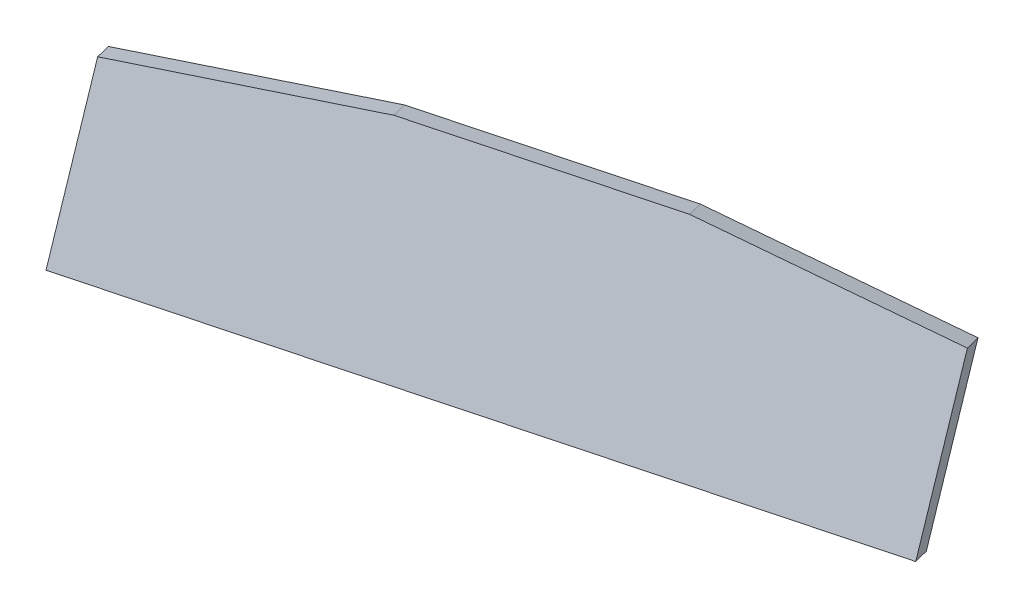
ISO-10303-21;
HEADER;
FILE_DESCRIPTION(('STEP AP214'),'2;1');
FILE_NAME('part.step','',(''),(''),'','','');
FILE_SCHEMA(('AUTOMOTIVE_DESIGN { 1 0 10303 214 1 1 1 1 }'));
ENDSEC;
DATA;
#1=APPLICATION_CONTEXT('core data for automotive mechanical design processes');
#2=APPLICATION_PROTOCOL_DEFINITION('international standard','automotive_design',2000,#1);
#3=PRODUCT_CONTEXT('',#1,'mechanical');
#4=PRODUCT('Part','Part','',(#3));
#5=PRODUCT_RELATED_PRODUCT_CATEGORY('part','',(#4));
#6=PRODUCT_DEFINITION_FORMATION('','',#4);
#7=PRODUCT_DEFINITION_CONTEXT('part definition',#1,'design');
#8=PRODUCT_DEFINITION('design','',#6,#7);
#9=PRODUCT_DEFINITION_SHAPE('','',#8);
#10=(LENGTH_UNIT() NAMED_UNIT(*) SI_UNIT(.MILLI.,.METRE.));
#11=(NAMED_UNIT(*) PLANE_ANGLE_UNIT() SI_UNIT($,.RADIAN.));
#12=(NAMED_UNIT(*) SI_UNIT($,.STERADIAN.) SOLID_ANGLE_UNIT());
#13=UNCERTAINTY_MEASURE_WITH_UNIT(LENGTH_MEASURE(1.E-05),#10,'distance_accuracy_value','');
#14=(GEOMETRIC_REPRESENTATION_CONTEXT(3) GLOBAL_UNCERTAINTY_ASSIGNED_CONTEXT((#13)) GLOBAL_UNIT_ASSIGNED_CONTEXT((#10,
#11,#12)) REPRESENTATION_CONTEXT('',''));
#15=CARTESIAN_POINT('',(0.,0.,0.));
#16=DIRECTION('',(0.,0.,1.));
#17=DIRECTION('',(1.,0.,0.));
#18=AXIS2_PLACEMENT_3D('',#15,#16,#17);
#19=CARTESIAN_POINT('',(124.,211.98475235449,-124.918123856454));
#20=DIRECTION('',(0.903470789906188,-0.132460029849933,-0.407670053202885));
#21=DIRECTION('',(-0.411294235020629,0.,-0.911502634246767));
#22=AXIS2_PLACEMENT_3D('',#19,#20,#21);
#23=PLANE('',#22);
#24=DIRECTION('',(0.,0.951056516295154,-0.309016994374947));
#25=VECTOR('',#24,1.);
#26=CARTESIAN_POINT('',(119.71350339104,133.108352770854,-108.789282126684));
#27=LINE('',#26,#25);
#28=CARTESIAN_POINT('',(119.71350339104,133.108352770854,-108.789282126684));
#29=VERTEX_POINT('',#28);
#30=CARTESIAN_POINT('',(119.71350339104,197.780195878924,-129.80243774418));
#31=VERTEX_POINT('',#30);
#32=EDGE_CURVE('E107',#29,#31,#27,.T.);
#33=ORIENTED_EDGE('',*,*,#32,.T.);
#34=DIRECTION('',(0.428649660896038,0.27918782800237,0.85925178202261));
#35=VECTOR('',#34,1.);
#36=CARTESIAN_POINT('',(1.29384842199959,120.651180555581,-367.181138443372));
#37=LINE('',#36,#35);
#38=CARTESIAN_POINT('',(124.,200.572074158948,-121.209919923954));
#39=VERTEX_POINT('',#38);
#40=EDGE_CURVE('E55',#31,#39,#37,.T.);
#41=ORIENTED_EDGE('',*,*,#40,.T.);
#42=DIRECTION('',(0.,-0.951056516295154,0.309016994374947));
#43=VECTOR('',#42,1.);
#44=CARTESIAN_POINT('',(124.,135.900231050877,-100.196764306458));
#45=LINE('',#44,#43);
#46=CARTESIAN_POINT('',(124.,135.900231050877,-100.196764306458));
#47=VERTEX_POINT('',#46);
#48=EDGE_CURVE('E104',#39,#47,#45,.T.);
#49=ORIENTED_EDGE('',*,*,#48,.T.);
#50=DIRECTION('',(-0.428649660896038,-0.279187828002372,-0.85925178202261));
#51=VECTOR('',#50,1.);
#52=CARTESIAN_POINT('',(124.,135.900231050877,-100.196764306458));
#53=LINE('',#52,#51);
#54=EDGE_CURVE('E123',#47,#29,#53,.T.);
#55=ORIENTED_EDGE('',*,*,#54,.T.);
#56=EDGE_LOOP('',(#33,#41,#49,#55));
#57=FACE_BOUND('',#56,.T.);
#58=ADVANCED_FACE('F40',(#57),#23,.T.);
#59=CARTESIAN_POINT('',(-122.856751695519,172.092494335495,11.1915685777226));
#60=DIRECTION('',(-0.428649660896038,-0.27918782800237,-0.85925178202261));
#61=DIRECTION('',(-0.894833483572199,0.,0.446400085884896));
#62=AXIS2_PLACEMENT_3D('',#59,#60,#61);
#63=PLANE('',#62);
#64=DIRECTION('',(-0.895368758447917,0.258354564960698,0.362722628408271));
#65=VECTOR('',#64,1.);
#66=CARTESIAN_POINT('',(31.622480966816,227.227185270193,-83.786884785186));
#67=LINE('',#66,#65);
#68=CARTESIAN_POINT('',(43.5910996983483,223.773695011134,-88.6354891213962));
#69=VERTEX_POINT('',#68);
#70=EDGE_CURVE('E91',#39,#69,#67,.T.);
#71=ORIENTED_EDGE('',*,*,#70,.T.);
#72=DIRECTION('',(0.903470789906188,-0.132460029849933,-0.407670053202885));
#73=VECTOR('',#72,1.);
#74=CARTESIAN_POINT('',(-122.85675169552,248.177015639107,-13.5297909722734));
#75=LINE('',#74,#73);
#76=CARTESIAN_POINT('',(-39.3046030893885,235.927233773394,-51.230742954366));
#77=VERTEX_POINT('',#76);
#78=EDGE_CURVE('E132',#77,#69,#75,.T.);
#79=ORIENTED_EDGE('',*,*,#78,.F.);
#80=DIRECTION('',(0.895368758447917,-0.00418977802359383,-0.445305773772976));
#81=VECTOR('',#80,1.);
#82=CARTESIAN_POINT('',(-27.3359843578547,235.871227959855,-57.1832569045715));
#83=LINE('',#82,#81);
#84=CARTESIAN_POINT('',(-119.71350339104,236.303498234497,-11.2399042868103));
#85=VERTEX_POINT('',#84);
#86=EDGE_CURVE('E154',#85,#77,#83,.T.);
#87=ORIENTED_EDGE('',*,*,#86,.F.);
#88=DIRECTION('',(0.,-0.951056516295154,0.309016994374947));
#89=VECTOR('',#88,1.);
#90=CARTESIAN_POINT('',(-119.713503391039,171.631655126426,9.7732513306865));
#91=LINE('',#90,#89);
#92=CARTESIAN_POINT('',(-119.713503391039,171.631655126426,9.7732513306865));
#93=VERTEX_POINT('',#92);
#94=EDGE_CURVE('E133',#85,#93,#91,.T.);
#95=ORIENTED_EDGE('',*,*,#94,.T.);
#96=DIRECTION('',(0.903470789906188,-0.132460029849933,-0.407670053202885));
#97=VECTOR('',#96,1.);
#98=CARTESIAN_POINT('',(-122.856751695519,172.092494335495,11.1915685777226));
#99=LINE('',#98,#97);
#100=EDGE_CURVE('E112',#93,#47,#99,.T.);
#101=ORIENTED_EDGE('',*,*,#100,.T.);
#102=ORIENTED_EDGE('',*,*,#48,.F.);
#103=EDGE_LOOP('',(#71,#79,#87,#95,#101,#102));
#104=FACE_BOUND('',#103,.T.);
#105=ADVANCED_FACE('F110',(#104),#63,.F.);
#106=CARTESIAN_POINT('',(-127.14324830448,245.385137359084,-22.1223087924998));
#107=DIRECTION('',(0.,-0.951056516295153,0.309016994374949));
#108=DIRECTION('',(0.,-0.309016994374949,-0.951056516295153));
#109=AXIS2_PLACEMENT_3D('',#106,#107,#108);
#110=PLANE('',#109);
#111=DIRECTION('',(0.428649660896038,0.27918782800237,0.85925178202261));
#112=VECTOR('',#111,1.);
#113=CARTESIAN_POINT('',(-79.1150518796523,143.852801407767,-334.606707640814));
#114=LINE('',#113,#112);
#115=CARTESIAN_POINT('',(39.3046030893879,220.98181673111,-97.2280069416227));
#116=VERTEX_POINT('',#115);
#117=EDGE_CURVE('E94',#116,#69,#114,.T.);
#118=ORIENTED_EDGE('',*,*,#117,.F.);
#119=DIRECTION('',(0.903470789906188,-0.132460029849933,-0.407670053202885));
#120=VECTOR('',#119,1.);
#121=CARTESIAN_POINT('',(-127.14324830448,245.385137359084,-22.1223087924998));
#122=LINE('',#121,#120);
#123=CARTESIAN_POINT('',(-43.5910996983481,233.13535549337,-59.8232607745925));
#124=VERTEX_POINT('',#123);
#125=EDGE_CURVE('E131',#124,#116,#122,.T.);
#126=ORIENTED_EDGE('',*,*,#125,.F.);
#127=DIRECTION('',(0.428649660896038,0.27918782800237,0.85925178202261));
#128=VECTOR('',#127,1.);
#129=CARTESIAN_POINT('',(-162.01075466739,156.006340170027,-297.201961473784));
#130=LINE('',#129,#128);
#131=EDGE_CURVE('E63',#124,#77,#130,.T.);
#132=ORIENTED_EDGE('',*,*,#131,.T.);
#133=ORIENTED_EDGE('',*,*,#78,.T.);
#134=EDGE_LOOP('',(#118,#126,#132,#133));
#135=FACE_BOUND('',#134,.T.);
#136=ADVANCED_FACE('F153',(#135),#110,.F.);
#137=CARTESIAN_POINT('',(-127.143248304479,169.300616055471,2.59905075749638));
#138=DIRECTION('',(0.428649660896038,0.27918782800237,0.85925178202261));
#139=DIRECTION('',(0.894833483572199,0.,-0.446400085884896));
#140=AXIS2_PLACEMENT_3D('',#137,#138,#139);
#141=PLANE('',#140);
#142=DIRECTION('',(-0.895368758447917,0.258354564960698,0.362722628408271));
#143=VECTOR('',#142,1.);
#144=CARTESIAN_POINT('',(-114.600032571026,265.390296272441,-34.8797359703051));
#145=LINE('',#144,#143);
#146=EDGE_CURVE('E11',#31,#116,#145,.T.);
#147=ORIENTED_EDGE('',*,*,#146,.F.);
#148=ORIENTED_EDGE('',*,*,#32,.F.);
#149=DIRECTION('',(0.903470789906188,-0.132460029849933,-0.407670053202885));
#150=VECTOR('',#149,1.);
#151=CARTESIAN_POINT('',(-127.143248304479,169.300616055471,2.59905075749638));
#152=LINE('',#151,#150);
#153=CARTESIAN_POINT('',(-123.999999999999,168.839776846402,1.18073351046044));
#154=VERTEX_POINT('',#153);
#155=EDGE_CURVE('E120',#154,#29,#152,.T.);
#156=ORIENTED_EDGE('',*,*,#155,.F.);
#157=DIRECTION('',(0.,0.951056516295154,-0.309016994374947));
#158=VECTOR('',#157,1.);
#159=CARTESIAN_POINT('',(-123.999999999999,168.839776846402,1.18073351046044));
#160=LINE('',#159,#158);
#161=CARTESIAN_POINT('',(-124.,233.511619954473,-19.8324221070363));
#162=VERTEX_POINT('',#161);
#163=EDGE_CURVE('E127',#154,#162,#160,.T.);
#164=ORIENTED_EDGE('',*,*,#163,.T.);
#165=DIRECTION('',(0.895368758447917,-0.00418977802359369,-0.445305773772976));
#166=VECTOR('',#165,1.);
#167=CARTESIAN_POINT('',(-135.222731861864,233.564135473778,-14.2508700945927));
#168=LINE('',#167,#166);
#169=EDGE_CURVE('E49',#162,#124,#168,.T.);
#170=ORIENTED_EDGE('',*,*,#169,.T.);
#171=ORIENTED_EDGE('',*,*,#125,.T.);
#172=EDGE_LOOP('',(#147,#148,#156,#164,#170,#171));
#173=FACE_BOUND('',#172,.T.);
#174=ADVANCED_FACE('F149',(#173),#141,.F.);
#175=CARTESIAN_POINT('',(-121.85675169552,17.8657120377743,54.9850078185719));
#176=DIRECTION('',(0.903470789906188,-0.132460029849933,-0.407670053202885));
#177=DIRECTION('',(-0.411294235020629,0.,-0.911502634246767));
#178=AXIS2_PLACEMENT_3D('',#175,#176,#177);
#179=PLANE('',#178);
#180=ORIENTED_EDGE('',*,*,#94,.F.);
#181=DIRECTION('',(0.428649660896038,0.27918782800237,0.85925178202261));
#182=VECTOR('',#181,1.);
#183=CARTESIAN_POINT('',(-242.41965496904,156.38260463113,-257.211122806228));
#184=LINE('',#183,#182);
#185=EDGE_CURVE('E158',#162,#85,#184,.T.);
#186=ORIENTED_EDGE('',*,*,#185,.F.);
#187=ORIENTED_EDGE('',*,*,#163,.F.);
#188=DIRECTION('',(-0.428649660896038,-0.279187828002372,-0.85925178202261));
#189=VECTOR('',#188,1.);
#190=CARTESIAN_POINT('',(-119.713503391039,171.631655126426,9.7732513306865));
#191=LINE('',#190,#189);
#192=EDGE_CURVE('E115',#93,#154,#191,.T.);
#193=ORIENTED_EDGE('',*,*,#192,.F.);
#194=EDGE_LOOP('',(#180,#186,#187,#193));
#195=FACE_BOUND('',#194,.T.);
#196=ADVANCED_FACE('F42',(#195),#179,.F.);
#197=CARTESIAN_POINT('',(-122.856751695519,172.092494335495,11.1915685777226));
#198=DIRECTION('',(0.,0.951056516295153,-0.309016994374949));
#199=DIRECTION('',(0.,0.309016994374949,0.951056516295153));
#200=AXIS2_PLACEMENT_3D('',#197,#198,#199);
#201=PLANE('',#200);
#202=ORIENTED_EDGE('',*,*,#100,.F.);
#203=ORIENTED_EDGE('',*,*,#192,.T.);
#204=ORIENTED_EDGE('',*,*,#155,.T.);
#205=ORIENTED_EDGE('',*,*,#54,.F.);
#206=EDGE_LOOP('',(#202,#203,#204,#205));
#207=FACE_BOUND('',#206,.T.);
#208=ADVANCED_FACE('F167',(#207),#201,.F.);
#209=CARTESIAN_POINT('',(-150.042135935856,155.950334356488,-303.154475423989));
#210=DIRECTION('',(0.12072387754354,-0.960227370186578,0.251772005861296));
#211=DIRECTION('',(0.,-0.253627001713326,-0.967302095522339));
#212=AXIS2_PLACEMENT_3D('',#209,#210,#211);
#213=PLANE('',#212);
#214=ORIENTED_EDGE('',*,*,#185,.T.);
#215=ORIENTED_EDGE('',*,*,#86,.T.);
#216=ORIENTED_EDGE('',*,*,#131,.F.);
#217=ORIENTED_EDGE('',*,*,#169,.F.);
#218=EDGE_LOOP('',(#214,#215,#216,#217));
#219=FACE_BOUND('',#218,.T.);
#220=ADVANCED_FACE('F172',(#219),#213,.F.);
#221=CARTESIAN_POINT('',(-91.0836706111847,147.306291666826,-329.758103304604));
#222=DIRECTION('',(0.12072387754354,0.924828132930269,-0.360719655593599));
#223=DIRECTION('',(0.,0.363377351641192,0.931642045162322));
#224=AXIS2_PLACEMENT_3D('',#221,#222,#223);
#225=PLANE('',#224);
#226=ORIENTED_EDGE('',*,*,#146,.T.);
#227=ORIENTED_EDGE('',*,*,#117,.T.);
#228=ORIENTED_EDGE('',*,*,#70,.F.);
#229=ORIENTED_EDGE('',*,*,#40,.F.);
#230=EDGE_LOOP('',(#226,#227,#228,#229));
#231=FACE_BOUND('',#230,.T.);
#232=ADVANCED_FACE('F92',(#231),#225,.T.);
#233=CLOSED_SHELL('',(#58,#105,#136,#174,#196,#208,#220,#232));
#234=MANIFOLD_SOLID_BREP('B2',#233);
#235=ADVANCED_BREP_SHAPE_REPRESENTATION('',(#18,#234),#14);
#236=SHAPE_DEFINITION_REPRESENTATION(#9,#235);
ENDSEC;
END-ISO-10303-21;
